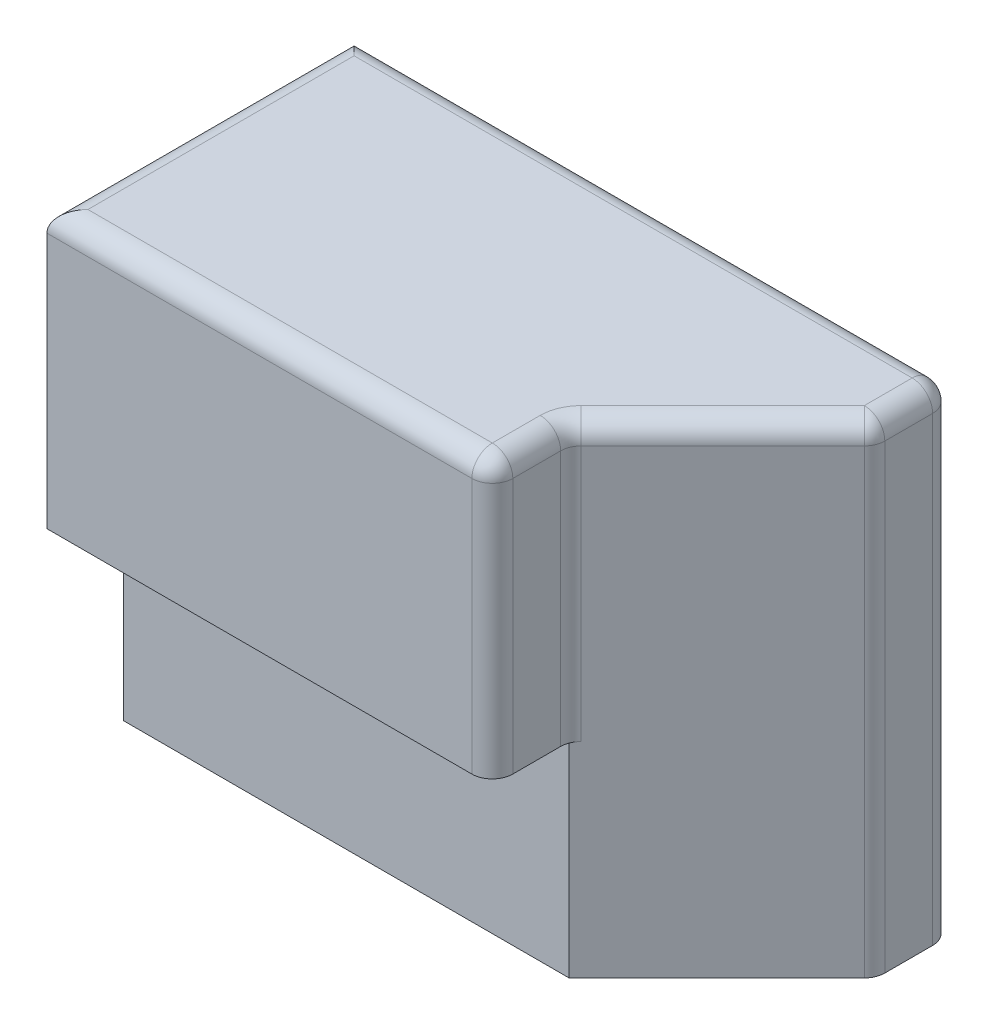
ISO-10303-21;
HEADER;
FILE_DESCRIPTION(('STEP AP214'),'2;1');
FILE_NAME('part.step','',(''),(''),'','','');
FILE_SCHEMA(('AUTOMOTIVE_DESIGN { 1 0 10303 214 1 1 1 1 }'));
ENDSEC;
DATA;
#1=APPLICATION_CONTEXT('core data for automotive mechanical design processes');
#2=APPLICATION_PROTOCOL_DEFINITION('international standard','automotive_design',2000,#1);
#3=PRODUCT_CONTEXT('',#1,'mechanical');
#4=PRODUCT('Part','Part','',(#3));
#5=PRODUCT_RELATED_PRODUCT_CATEGORY('part','',(#4));
#6=PRODUCT_DEFINITION_FORMATION('','',#4);
#7=PRODUCT_DEFINITION_CONTEXT('part definition',#1,'design');
#8=PRODUCT_DEFINITION('design','',#6,#7);
#9=PRODUCT_DEFINITION_SHAPE('','',#8);
#10=(LENGTH_UNIT() NAMED_UNIT(*) SI_UNIT(.MILLI.,.METRE.));
#11=(NAMED_UNIT(*) PLANE_ANGLE_UNIT() SI_UNIT($,.RADIAN.));
#12=(NAMED_UNIT(*) SI_UNIT($,.STERADIAN.) SOLID_ANGLE_UNIT());
#13=UNCERTAINTY_MEASURE_WITH_UNIT(LENGTH_MEASURE(1.E-05),#10,'distance_accuracy_value','');
#14=(GEOMETRIC_REPRESENTATION_CONTEXT(3) GLOBAL_UNCERTAINTY_ASSIGNED_CONTEXT((#13)) GLOBAL_UNIT_ASSIGNED_CONTEXT((#10,
#11,#12)) REPRESENTATION_CONTEXT('',''));
#15=CARTESIAN_POINT('',(0.,0.,0.));
#16=DIRECTION('',(0.,0.,1.));
#17=DIRECTION('',(1.,0.,0.));
#18=AXIS2_PLACEMENT_3D('',#15,#16,#17);
#19=CARTESIAN_POINT('',(0.,0.,7.62));
#20=DIRECTION('',(0.,1.,0.));
#21=DIRECTION('',(0.,0.,1.));
#22=AXIS2_PLACEMENT_3D('',#19,#20,#21);
#23=PLANE('',#22);
#24=DIRECTION('',(1.,0.,0.));
#25=VECTOR('',#24,1.);
#26=CARTESIAN_POINT('',(0.,0.,0.));
#27=LINE('',#26,#25);
#28=CARTESIAN_POINT('',(10.16,0.,0.));
#29=VERTEX_POINT('',#28);
#30=CARTESIAN_POINT('',(14.351,0.,0.));
#31=VERTEX_POINT('',#30);
#32=EDGE_CURVE('E269',#29,#31,#27,.T.);
#33=ORIENTED_EDGE('',*,*,#32,.T.);
#34=CARTESIAN_POINT('',(14.351,0.,0.508));
#35=DIRECTION('',(0.,1.,0.));
#36=DIRECTION('',(0.,0.,1.));
#37=AXIS2_PLACEMENT_3D('',#34,#35,#36);
#38=CIRCLE('',#37,0.508);
#39=CARTESIAN_POINT('',(14.859,0.,0.508000000000002));
#40=VERTEX_POINT('',#39);
#41=EDGE_CURVE('E330',#31,#40,#38,.F.);
#42=ORIENTED_EDGE('',*,*,#41,.T.);
#43=DIRECTION('',(0.,0.,-1.));
#44=VECTOR('',#43,1.);
#45=CARTESIAN_POINT('',(14.859,0.,7.62));
#46=LINE('',#45,#44);
#47=CARTESIAN_POINT('',(14.859,0.,1.69457951031445));
#48=VERTEX_POINT('',#47);
#49=EDGE_CURVE('E268',#48,#40,#46,.T.);
#50=ORIENTED_EDGE('',*,*,#49,.F.);
#51=CARTESIAN_POINT('',(14.351,0.,1.69457951031445));
#52=DIRECTION('',(0.,1.,0.));
#53=DIRECTION('',(0.,0.,1.));
#54=AXIS2_PLACEMENT_3D('',#51,#52,#53);
#55=CIRCLE('',#54,0.508);
#56=CARTESIAN_POINT('',(14.7102102448428,0.,2.05378975515721));
#57=VERTEX_POINT('',#56);
#58=EDGE_CURVE('E197',#48,#57,#55,.F.);
#59=ORIENTED_EDGE('',*,*,#58,.T.);
#60=DIRECTION('',(0.707106781186546,0.,-0.707106781186549));
#61=VECTOR('',#60,1.);
#62=CARTESIAN_POINT('',(8.38200000000002,0.,8.38199999999999));
#63=LINE('',#62,#61);
#64=CARTESIAN_POINT('',(11.049,0.,5.715));
#65=VERTEX_POINT('',#64);
#66=EDGE_CURVE('E179',#65,#57,#63,.T.);
#67=ORIENTED_EDGE('',*,*,#66,.F.);
#68=DIRECTION('',(1.,0.,0.));
#69=VECTOR('',#68,1.);
#70=CARTESIAN_POINT('',(0.,0.,5.715));
#71=LINE('',#70,#69);
#72=CARTESIAN_POINT('',(0.,0.,5.715));
#73=VERTEX_POINT('',#72);
#74=EDGE_CURVE('E193',#73,#65,#71,.T.);
#75=ORIENTED_EDGE('',*,*,#74,.F.);
#76=DIRECTION('',(0.,0.,-1.));
#77=VECTOR('',#76,1.);
#78=CARTESIAN_POINT('',(0.,0.,7.62));
#79=LINE('',#78,#77);
#80=CARTESIAN_POINT('',(0.,0.,2.794));
#81=VERTEX_POINT('',#80);
#82=EDGE_CURVE('E277',#73,#81,#79,.T.);
#83=ORIENTED_EDGE('',*,*,#82,.T.);
#84=DIRECTION('',(-1.,0.,0.));
#85=VECTOR('',#84,1.);
#86=CARTESIAN_POINT('',(0.,0.,2.794));
#87=LINE('',#86,#85);
#88=CARTESIAN_POINT('',(10.16,0.,2.794));
#89=VERTEX_POINT('',#88);
#90=EDGE_CURVE('E237',#89,#81,#87,.T.);
#91=ORIENTED_EDGE('',*,*,#90,.F.);
#92=DIRECTION('',(0.,0.,-1.));
#93=VECTOR('',#92,1.);
#94=CARTESIAN_POINT('',(10.16,0.,2.794));
#95=LINE('',#94,#93);
#96=EDGE_CURVE('E251',#89,#29,#95,.T.);
#97=ORIENTED_EDGE('',*,*,#96,.T.);
#98=EDGE_LOOP('',(#33,#42,#50,#59,#67,#75,#83,#91,#97));
#99=FACE_BOUND('',#98,.T.);
#100=ADVANCED_FACE('F39',(#99),#23,.F.);
#101=CARTESIAN_POINT('',(14.859,0.,7.62));
#102=DIRECTION('',(-1.,0.,0.));
#103=DIRECTION('',(0.,0.,1.));
#104=AXIS2_PLACEMENT_3D('',#101,#102,#103);
#105=PLANE('',#104);
#106=ORIENTED_EDGE('',*,*,#49,.T.);
#107=DIRECTION('',(0.,1.,0.));
#108=VECTOR('',#107,1.);
#109=CARTESIAN_POINT('',(14.859,11.938,0.508));
#110=LINE('',#109,#108);
#111=CARTESIAN_POINT('',(14.859,11.43,0.508));
#112=VERTEX_POINT('',#111);
#113=EDGE_CURVE('E319',#40,#112,#110,.T.);
#114=ORIENTED_EDGE('',*,*,#113,.T.);
#115=DIRECTION('',(0.,0.,-1.));
#116=VECTOR('',#115,1.);
#117=CARTESIAN_POINT('',(14.859,11.43,7.62));
#118=LINE('',#117,#116);
#119=CARTESIAN_POINT('',(14.859,11.43,1.69457951031445));
#120=VERTEX_POINT('',#119);
#121=EDGE_CURVE('E316',#112,#120,#118,.F.);
#122=ORIENTED_EDGE('',*,*,#121,.T.);
#123=DIRECTION('',(0.,1.,0.));
#124=VECTOR('',#123,1.);
#125=CARTESIAN_POINT('',(14.859,0.,1.69457951031445));
#126=LINE('',#125,#124);
#127=EDGE_CURVE('E313',#120,#48,#126,.F.);
#128=ORIENTED_EDGE('',*,*,#127,.T.);
#129=EDGE_LOOP('',(#106,#114,#122,#128));
#130=FACE_BOUND('',#129,.T.);
#131=ADVANCED_FACE('F473',(#130),#105,.F.);
#132=CARTESIAN_POINT('',(0.,11.938,7.62));
#133=DIRECTION('',(0.,-1.,0.));
#134=DIRECTION('',(0.,0.,-1.));
#135=AXIS2_PLACEMENT_3D('',#132,#133,#134);
#136=PLANE('',#135);
#137=DIRECTION('',(0.707106781186546,0.,-0.707106781186549));
#138=VECTOR('',#137,1.);
#139=CARTESIAN_POINT('',(14.4997897551572,11.938,1.54578975515722));
#140=LINE('',#139,#138);
#141=CARTESIAN_POINT('',(10.8385795103145,11.938,5.207));
#142=VERTEX_POINT('',#141);
#143=CARTESIAN_POINT('',(14.351,11.938,1.69457951031445));
#144=VERTEX_POINT('',#143);
#145=EDGE_CURVE('E307',#142,#144,#140,.T.);
#146=ORIENTED_EDGE('',*,*,#145,.T.);
#147=DIRECTION('',(0.,0.,-1.));
#148=VECTOR('',#147,1.);
#149=CARTESIAN_POINT('',(14.351,11.938,7.62));
#150=LINE('',#149,#148);
#151=CARTESIAN_POINT('',(14.351,11.938,0.508));
#152=VERTEX_POINT('',#151);
#153=EDGE_CURVE('E310',#144,#152,#150,.T.);
#154=ORIENTED_EDGE('',*,*,#153,.T.);
#155=DIRECTION('',(-1.,0.,0.));
#156=VECTOR('',#155,1.);
#157=CARTESIAN_POINT('',(0.,11.938,0.508));
#158=LINE('',#157,#156);
#159=CARTESIAN_POINT('',(0.508,11.938,0.508));
#160=VERTEX_POINT('',#159);
#161=EDGE_CURVE('E300',#152,#160,#158,.T.);
#162=ORIENTED_EDGE('',*,*,#161,.T.);
#163=DIRECTION('',(0.,0.,-1.));
#164=VECTOR('',#163,1.);
#165=CARTESIAN_POINT('',(0.508,11.938,7.62));
#166=LINE('',#165,#164);
#167=CARTESIAN_POINT('',(0.508,11.938,7.112));
#168=VERTEX_POINT('',#167);
#169=EDGE_CURVE('E293',#160,#168,#166,.F.);
#170=ORIENTED_EDGE('',*,*,#169,.T.);
#171=DIRECTION('',(-1.,0.,0.));
#172=VECTOR('',#171,1.);
#173=CARTESIAN_POINT('',(0.,11.938,7.112));
#174=LINE('',#173,#172);
#175=CARTESIAN_POINT('',(10.541,11.938,7.112));
#176=VERTEX_POINT('',#175);
#177=EDGE_CURVE('E290',#168,#176,#174,.F.);
#178=ORIENTED_EDGE('',*,*,#177,.T.);
#179=DIRECTION('',(0.,0.,1.));
#180=VECTOR('',#179,1.);
#181=CARTESIAN_POINT('',(10.541,11.938,7.62));
#182=LINE('',#181,#180);
#183=CARTESIAN_POINT('',(10.541,11.938,5.92542048968553));
#184=VERTEX_POINT('',#183);
#185=EDGE_CURVE('E296',#176,#184,#182,.F.);
#186=ORIENTED_EDGE('',*,*,#185,.T.);
#187=CARTESIAN_POINT('',(11.557,11.938,5.92542048968553));
#188=DIRECTION('',(0.,-1.,0.));
#189=DIRECTION('',(0.,0.,-1.));
#190=AXIS2_PLACEMENT_3D('',#187,#188,#189);
#191=CIRCLE('',#190,1.016);
#192=EDGE_CURVE('E303',#142,#184,#191,.F.);
#193=ORIENTED_EDGE('',*,*,#192,.F.);
#194=EDGE_LOOP('',(#146,#154,#162,#170,#178,#186,#193));
#195=FACE_BOUND('',#194,.T.);
#196=ADVANCED_FACE('F423',(#195),#136,.F.);
#197=CARTESIAN_POINT('',(0.,0.,5.715));
#198=DIRECTION('',(0.,0.,1.));
#199=DIRECTION('',(1.,0.,0.));
#200=AXIS2_PLACEMENT_3D('',#197,#198,#199);
#201=PLANE('',#200);
#202=ORIENTED_EDGE('',*,*,#74,.T.);
#203=DIRECTION('',(0.,1.,0.));
#204=VECTOR('',#203,1.);
#205=CARTESIAN_POINT('',(11.049,0.,5.715));
#206=LINE('',#205,#204);
#207=CARTESIAN_POINT('',(11.049,5.08,5.715));
#208=VERTEX_POINT('',#207);
#209=EDGE_CURVE('E176',#65,#208,#206,.T.);
#210=ORIENTED_EDGE('',*,*,#209,.T.);
#211=DIRECTION('',(1.,0.,0.));
#212=VECTOR('',#211,1.);
#213=CARTESIAN_POINT('',(0.,5.08,5.715));
#214=LINE('',#213,#212);
#215=CARTESIAN_POINT('',(0.,5.08,5.715));
#216=VERTEX_POINT('',#215);
#217=EDGE_CURVE('E210',#216,#208,#214,.T.);
#218=ORIENTED_EDGE('',*,*,#217,.F.);
#219=DIRECTION('',(0.,-1.,0.));
#220=VECTOR('',#219,1.);
#221=CARTESIAN_POINT('',(0.,0.,5.715));
#222=LINE('',#221,#220);
#223=EDGE_CURVE('E202',#216,#73,#222,.T.);
#224=ORIENTED_EDGE('',*,*,#223,.T.);
#225=EDGE_LOOP('',(#202,#210,#218,#224));
#226=FACE_BOUND('',#225,.T.);
#227=ADVANCED_FACE('F200',(#226),#201,.T.);
#228=CARTESIAN_POINT('',(0.,0.,7.62));
#229=DIRECTION('',(1.,0.,0.));
#230=DIRECTION('',(0.,0.,-1.));
#231=AXIS2_PLACEMENT_3D('',#228,#229,#230);
#232=PLANE('',#231);
#233=DIRECTION('',(0.,-1.,0.));
#234=VECTOR('',#233,1.);
#235=CARTESIAN_POINT('',(0.,0.,7.62));
#236=LINE('',#235,#234);
#237=CARTESIAN_POINT('',(0.,11.43,7.62));
#238=VERTEX_POINT('',#237);
#239=CARTESIAN_POINT('',(0.,5.08,7.62));
#240=VERTEX_POINT('',#239);
#241=EDGE_CURVE('E265',#238,#240,#236,.T.);
#242=ORIENTED_EDGE('',*,*,#241,.F.);
#243=DIRECTION('',(0.,0.,-1.));
#244=VECTOR('',#243,1.);
#245=CARTESIAN_POINT('',(0.,11.43,7.62));
#246=LINE('',#245,#244);
#247=CARTESIAN_POINT('',(0.,11.43,0.));
#248=VERTEX_POINT('',#247);
#249=EDGE_CURVE('E333',#238,#248,#246,.T.);
#250=ORIENTED_EDGE('',*,*,#249,.T.);
#251=DIRECTION('',(0.,-1.,0.));
#252=VECTOR('',#251,1.);
#253=CARTESIAN_POINT('',(0.,0.,0.));
#254=LINE('',#253,#252);
#255=CARTESIAN_POINT('',(0.,10.16,0.));
#256=VERTEX_POINT('',#255);
#257=EDGE_CURVE('E255',#248,#256,#254,.T.);
#258=ORIENTED_EDGE('',*,*,#257,.T.);
#259=DIRECTION('',(0.,0.,-1.));
#260=VECTOR('',#259,1.);
#261=CARTESIAN_POINT('',(0.,10.16,2.794));
#262=LINE('',#261,#260);
#263=CARTESIAN_POINT('',(0.,10.16,2.794));
#264=VERTEX_POINT('',#263);
#265=EDGE_CURVE('E241',#264,#256,#262,.T.);
#266=ORIENTED_EDGE('',*,*,#265,.F.);
#267=DIRECTION('',(0.,1.,0.));
#268=VECTOR('',#267,1.);
#269=CARTESIAN_POINT('',(0.,0.,2.794));
#270=LINE('',#269,#268);
#271=EDGE_CURVE('E220',#81,#264,#270,.T.);
#272=ORIENTED_EDGE('',*,*,#271,.F.);
#273=ORIENTED_EDGE('',*,*,#82,.F.);
#274=ORIENTED_EDGE('',*,*,#223,.F.);
#275=DIRECTION('',(0.,0.,1.));
#276=VECTOR('',#275,1.);
#277=CARTESIAN_POINT('',(0.,5.08,5.715));
#278=LINE('',#277,#276);
#279=EDGE_CURVE('E208',#216,#240,#278,.T.);
#280=ORIENTED_EDGE('',*,*,#279,.T.);
#281=EDGE_LOOP('',(#242,#250,#258,#266,#272,#273,#274,#280));
#282=FACE_BOUND('',#281,.T.);
#283=ADVANCED_FACE('F482',(#282),#232,.F.);
#284=CARTESIAN_POINT('',(0.,0.,7.62));
#285=DIRECTION('',(0.,0.,-1.));
#286=DIRECTION('',(-1.,0.,0.));
#287=AXIS2_PLACEMENT_3D('',#284,#285,#286);
#288=PLANE('',#287);
#289=DIRECTION('',(1.,0.,0.));
#290=VECTOR('',#289,1.);
#291=CARTESIAN_POINT('',(0.,5.08,7.62));
#292=LINE('',#291,#290);
#293=CARTESIAN_POINT('',(10.541,5.08,7.62));
#294=VERTEX_POINT('',#293);
#295=EDGE_CURVE('E188',#240,#294,#292,.T.);
#296=ORIENTED_EDGE('',*,*,#295,.T.);
#297=DIRECTION('',(0.,-1.,0.));
#298=VECTOR('',#297,1.);
#299=CARTESIAN_POINT('',(10.541,0.,7.62));
#300=LINE('',#299,#298);
#301=CARTESIAN_POINT('',(10.541,11.43,7.62));
#302=VERTEX_POINT('',#301);
#303=EDGE_CURVE('E49',#294,#302,#300,.F.);
#304=ORIENTED_EDGE('',*,*,#303,.T.);
#305=DIRECTION('',(-1.,0.,0.));
#306=VECTOR('',#305,1.);
#307=CARTESIAN_POINT('',(0.,11.43,7.62));
#308=LINE('',#307,#306);
#309=EDGE_CURVE('E349',#302,#238,#308,.T.);
#310=ORIENTED_EDGE('',*,*,#309,.T.);
#311=ORIENTED_EDGE('',*,*,#241,.T.);
#312=EDGE_LOOP('',(#296,#304,#310,#311));
#313=FACE_BOUND('',#312,.T.);
#314=ADVANCED_FACE('F485',(#313),#288,.F.);
#315=CARTESIAN_POINT('',(0.,0.,0.));
#316=DIRECTION('',(0.,0.,-1.));
#317=DIRECTION('',(-1.,0.,0.));
#318=AXIS2_PLACEMENT_3D('',#315,#316,#317);
#319=PLANE('',#318);
#320=DIRECTION('',(-1.,0.,0.));
#321=VECTOR('',#320,1.);
#322=CARTESIAN_POINT('',(14.859,11.43,0.));
#323=LINE('',#322,#321);
#324=CARTESIAN_POINT('',(14.351,11.43,0.));
#325=VERTEX_POINT('',#324);
#326=EDGE_CURVE('E322',#248,#325,#323,.F.);
#327=ORIENTED_EDGE('',*,*,#326,.T.);
#328=DIRECTION('',(0.,1.,0.));
#329=VECTOR('',#328,1.);
#330=CARTESIAN_POINT('',(14.351,0.,0.));
#331=LINE('',#330,#329);
#332=EDGE_CURVE('E325',#325,#31,#331,.F.);
#333=ORIENTED_EDGE('',*,*,#332,.T.);
#334=ORIENTED_EDGE('',*,*,#32,.F.);
#335=DIRECTION('',(0.,-1.,0.));
#336=VECTOR('',#335,1.);
#337=CARTESIAN_POINT('',(10.16,0.,0.));
#338=LINE('',#337,#336);
#339=CARTESIAN_POINT('',(10.16,8.255,0.));
#340=VERTEX_POINT('',#339);
#341=EDGE_CURVE('E225',#340,#29,#338,.T.);
#342=ORIENTED_EDGE('',*,*,#341,.F.);
#343=CARTESIAN_POINT('',(8.255,8.255,0.));
#344=DIRECTION('',(0.,0.,-1.));
#345=DIRECTION('',(-1.,0.,0.));
#346=AXIS2_PLACEMENT_3D('',#343,#344,#345);
#347=CIRCLE('',#346,1.905);
#348=CARTESIAN_POINT('',(8.255,10.16,0.));
#349=VERTEX_POINT('',#348);
#350=EDGE_CURVE('E245',#349,#340,#347,.T.);
#351=ORIENTED_EDGE('',*,*,#350,.F.);
#352=DIRECTION('',(1.,0.,0.));
#353=VECTOR('',#352,1.);
#354=CARTESIAN_POINT('',(0.,10.16,0.));
#355=LINE('',#354,#353);
#356=EDGE_CURVE('E218',#256,#349,#355,.T.);
#357=ORIENTED_EDGE('',*,*,#356,.F.);
#358=ORIENTED_EDGE('',*,*,#257,.F.);
#359=EDGE_LOOP('',(#327,#333,#334,#342,#351,#357,#358));
#360=FACE_BOUND('',#359,.T.);
#361=ADVANCED_FACE('F520',(#360),#319,.T.);
#362=CARTESIAN_POINT('',(10.16,0.,2.794));
#363=DIRECTION('',(1.,0.,0.));
#364=DIRECTION('',(0.,1.,0.));
#365=AXIS2_PLACEMENT_3D('',#362,#363,#364);
#366=PLANE('',#365);
#367=ORIENTED_EDGE('',*,*,#341,.T.);
#368=ORIENTED_EDGE('',*,*,#96,.F.);
#369=DIRECTION('',(0.,-1.,0.));
#370=VECTOR('',#369,1.);
#371=CARTESIAN_POINT('',(10.16,0.,2.794));
#372=LINE('',#371,#370);
#373=CARTESIAN_POINT('',(10.16,8.255,2.794));
#374=VERTEX_POINT('',#373);
#375=EDGE_CURVE('E233',#374,#89,#372,.T.);
#376=ORIENTED_EDGE('',*,*,#375,.F.);
#377=DIRECTION('',(0.,0.,-1.));
#378=VECTOR('',#377,1.);
#379=CARTESIAN_POINT('',(10.16,8.255,2.794));
#380=LINE('',#379,#378);
#381=EDGE_CURVE('E256',#374,#340,#380,.T.);
#382=ORIENTED_EDGE('',*,*,#381,.T.);
#383=EDGE_LOOP('',(#367,#368,#376,#382));
#384=FACE_BOUND('',#383,.T.);
#385=ADVANCED_FACE('F516',(#384),#366,.F.);
#386=CARTESIAN_POINT('',(8.255,8.255,2.794));
#387=DIRECTION('',(0.,0.,-1.));
#388=DIRECTION('',(-1.,0.,0.));
#389=AXIS2_PLACEMENT_3D('',#386,#387,#388);
#390=CYLINDRICAL_SURFACE('',#389,1.905);
#391=ORIENTED_EDGE('',*,*,#350,.T.);
#392=ORIENTED_EDGE('',*,*,#381,.F.);
#393=CARTESIAN_POINT('',(8.255,8.255,2.794));
#394=DIRECTION('',(0.,0.,-1.));
#395=DIRECTION('',(-1.,0.,0.));
#396=AXIS2_PLACEMENT_3D('',#393,#394,#395);
#397=CIRCLE('',#396,1.905);
#398=CARTESIAN_POINT('',(8.255,10.16,2.794));
#399=VERTEX_POINT('',#398);
#400=EDGE_CURVE('E229',#399,#374,#397,.T.);
#401=ORIENTED_EDGE('',*,*,#400,.F.);
#402=DIRECTION('',(0.,0.,-1.));
#403=VECTOR('',#402,1.);
#404=CARTESIAN_POINT('',(8.255,10.16,2.794));
#405=LINE('',#404,#403);
#406=EDGE_CURVE('E259',#399,#349,#405,.T.);
#407=ORIENTED_EDGE('',*,*,#406,.T.);
#408=EDGE_LOOP('',(#391,#392,#401,#407));
#409=FACE_BOUND('',#408,.T.);
#410=ADVANCED_FACE('F519',(#409),#390,.F.);
#411=CARTESIAN_POINT('',(0.,10.16,2.794));
#412=DIRECTION('',(0.,1.,0.));
#413=DIRECTION('',(-1.,0.,0.));
#414=AXIS2_PLACEMENT_3D('',#411,#412,#413);
#415=PLANE('',#414);
#416=ORIENTED_EDGE('',*,*,#356,.T.);
#417=ORIENTED_EDGE('',*,*,#406,.F.);
#418=DIRECTION('',(1.,0.,0.));
#419=VECTOR('',#418,1.);
#420=CARTESIAN_POINT('',(0.,10.16,2.794));
#421=LINE('',#420,#419);
#422=EDGE_CURVE('E224',#264,#399,#421,.T.);
#423=ORIENTED_EDGE('',*,*,#422,.F.);
#424=ORIENTED_EDGE('',*,*,#265,.T.);
#425=EDGE_LOOP('',(#416,#417,#423,#424));
#426=FACE_BOUND('',#425,.T.);
#427=ADVANCED_FACE('F514',(#426),#415,.F.);
#428=CARTESIAN_POINT('',(8.255,8.255,2.794));
#429=DIRECTION('',(0.,0.,-1.));
#430=DIRECTION('',(-1.,0.,0.));
#431=AXIS2_PLACEMENT_3D('',#428,#429,#430);
#432=PLANE('',#431);
#433=CARTESIAN_POINT('',(3.81,3.81,2.794));
#434=DIRECTION('',(0.,0.,-1.));
#435=DIRECTION('',(-1.,0.,0.));
#436=AXIS2_PLACEMENT_3D('',#433,#434,#435);
#437=CIRCLE('',#436,0.635000000000001);
#438=CARTESIAN_POINT('',(3.175,3.81,2.794));
#439=VERTEX_POINT('',#438);
#440=EDGE_CURVE('E744',#439,#439,#437,.T.);
#441=ORIENTED_EDGE('',*,*,#440,.F.);
#442=EDGE_LOOP('',(#441));
#443=FACE_BOUND('',#442,.T.);
#444=ORIENTED_EDGE('',*,*,#271,.T.);
#445=ORIENTED_EDGE('',*,*,#422,.T.);
#446=ORIENTED_EDGE('',*,*,#400,.T.);
#447=ORIENTED_EDGE('',*,*,#375,.T.);
#448=ORIENTED_EDGE('',*,*,#90,.T.);
#449=EDGE_LOOP('',(#444,#445,#446,#447,#448));
#450=FACE_BOUND('',#449,.T.);
#451=ADVANCED_FACE('F509',(#443,#450),#432,.T.);
#452=CARTESIAN_POINT('',(0.,5.08,5.715));
#453=DIRECTION('',(0.,-1.,0.));
#454=DIRECTION('',(0.,0.,-1.));
#455=AXIS2_PLACEMENT_3D('',#452,#453,#454);
#456=PLANE('',#455);
#457=DIRECTION('',(0.,0.,1.));
#458=VECTOR('',#457,1.);
#459=CARTESIAN_POINT('',(11.049,5.08,5.715));
#460=LINE('',#459,#458);
#461=CARTESIAN_POINT('',(11.049,5.08,5.92542048968553));
#462=VERTEX_POINT('',#461);
#463=CARTESIAN_POINT('',(11.049,5.08,7.112));
#464=VERTEX_POINT('',#463);
#465=EDGE_CURVE('E204',#462,#464,#460,.T.);
#466=ORIENTED_EDGE('',*,*,#465,.T.);
#467=CARTESIAN_POINT('',(10.541,5.08,7.112));
#468=DIRECTION('',(0.,-1.,0.));
#469=DIRECTION('',(0.,0.,-1.));
#470=AXIS2_PLACEMENT_3D('',#467,#468,#469);
#471=CIRCLE('',#470,0.508);
#472=EDGE_CURVE('E64',#464,#294,#471,.T.);
#473=ORIENTED_EDGE('',*,*,#472,.T.);
#474=ORIENTED_EDGE('',*,*,#295,.F.);
#475=ORIENTED_EDGE('',*,*,#279,.F.);
#476=ORIENTED_EDGE('',*,*,#217,.T.);
#477=DIRECTION('',(-0.707106781186546,0.,0.707106781186549));
#478=VECTOR('',#477,1.);
#479=CARTESIAN_POINT('',(5.52450000000002,5.08,11.2395));
#480=LINE('',#479,#478);
#481=CARTESIAN_POINT('',(11.1977897551572,5.08,5.56621024484276));
#482=VERTEX_POINT('',#481);
#483=EDGE_CURVE('E182',#482,#208,#480,.T.);
#484=ORIENTED_EDGE('',*,*,#483,.F.);
#485=CARTESIAN_POINT('',(11.557,5.08,5.92542048968553));
#486=DIRECTION('',(0.,-1.,0.));
#487=DIRECTION('',(0.,0.,-1.));
#488=AXIS2_PLACEMENT_3D('',#485,#486,#487);
#489=CIRCLE('',#488,0.508);
#490=EDGE_CURVE('E11',#482,#462,#489,.F.);
#491=ORIENTED_EDGE('',*,*,#490,.T.);
#492=EDGE_LOOP('',(#466,#473,#474,#475,#476,#484,#491));
#493=FACE_BOUND('',#492,.T.);
#494=ADVANCED_FACE('F444',(#493),#456,.T.);
#495=CARTESIAN_POINT('',(11.049,0.,5.715));
#496=DIRECTION('',(-1.,0.,0.));
#497=DIRECTION('',(0.,0.,1.));
#498=AXIS2_PLACEMENT_3D('',#495,#496,#497);
#499=PLANE('',#498);
#500=ORIENTED_EDGE('',*,*,#465,.F.);
#501=DIRECTION('',(0.,-1.,0.));
#502=VECTOR('',#501,1.);
#503=CARTESIAN_POINT('',(11.049,0.,5.92542048968553));
#504=LINE('',#503,#502);
#505=CARTESIAN_POINT('',(11.049,11.43,5.92542048968553));
#506=VERTEX_POINT('',#505);
#507=EDGE_CURVE('E287',#462,#506,#504,.F.);
#508=ORIENTED_EDGE('',*,*,#507,.T.);
#509=DIRECTION('',(0.,0.,1.));
#510=VECTOR('',#509,1.);
#511=CARTESIAN_POINT('',(11.049,11.43,5.715));
#512=LINE('',#511,#510);
#513=CARTESIAN_POINT('',(11.049,11.43,7.112));
#514=VERTEX_POINT('',#513);
#515=EDGE_CURVE('E283',#506,#514,#512,.T.);
#516=ORIENTED_EDGE('',*,*,#515,.T.);
#517=DIRECTION('',(0.,-1.,0.));
#518=VECTOR('',#517,1.);
#519=CARTESIAN_POINT('',(11.049,0.,7.112));
#520=LINE('',#519,#518);
#521=EDGE_CURVE('E280',#514,#464,#520,.T.);
#522=ORIENTED_EDGE('',*,*,#521,.T.);
#523=EDGE_LOOP('',(#500,#508,#516,#522));
#524=FACE_BOUND('',#523,.T.);
#525=ADVANCED_FACE('F446',(#524),#499,.F.);
#526=CARTESIAN_POINT('',(8.38200000000002,0.,8.38199999999999));
#527=DIRECTION('',(0.707106781186549,0.,0.707106781186546));
#528=DIRECTION('',(0.707106781186546,0.,-0.707106781186549));
#529=AXIS2_PLACEMENT_3D('',#526,#527,#528);
#530=PLANE('',#529);
#531=ORIENTED_EDGE('',*,*,#66,.T.);
#532=DIRECTION('',(0.,1.,0.));
#533=VECTOR('',#532,1.);
#534=CARTESIAN_POINT('',(14.7102102448428,11.938,2.05378975515721));
#535=LINE('',#534,#533);
#536=CARTESIAN_POINT('',(14.7102102448428,11.43,2.05378975515721));
#537=VERTEX_POINT('',#536);
#538=EDGE_CURVE('E344',#57,#537,#535,.T.);
#539=ORIENTED_EDGE('',*,*,#538,.T.);
#540=DIRECTION('',(0.707106781186546,0.,-0.707106781186549));
#541=VECTOR('',#540,1.);
#542=CARTESIAN_POINT('',(11.049,11.43,5.715));
#543=LINE('',#542,#541);
#544=CARTESIAN_POINT('',(11.1977897551572,11.43,5.56621024484276));
#545=VERTEX_POINT('',#544);
#546=EDGE_CURVE('E341',#537,#545,#543,.F.);
#547=ORIENTED_EDGE('',*,*,#546,.T.);
#548=DIRECTION('',(0.,-1.,0.));
#549=VECTOR('',#548,1.);
#550=CARTESIAN_POINT('',(11.1977897551572,0.,5.56621024484276));
#551=LINE('',#550,#549);
#552=EDGE_CURVE('E338',#545,#482,#551,.T.);
#553=ORIENTED_EDGE('',*,*,#552,.T.);
#554=ORIENTED_EDGE('',*,*,#483,.T.);
#555=ORIENTED_EDGE('',*,*,#209,.F.);
#556=EDGE_LOOP('',(#531,#539,#547,#553,#554,#555));
#557=FACE_BOUND('',#556,.T.);
#558=ADVANCED_FACE('F178',(#557),#530,.T.);
#559=CARTESIAN_POINT('',(14.351,0.,0.508));
#560=DIRECTION('',(0.,-1.,0.));
#561=DIRECTION('',(0.,0.,-1.));
#562=AXIS2_PLACEMENT_3D('',#559,#560,#561);
#563=CYLINDRICAL_SURFACE('',#562,0.508);
#564=CARTESIAN_POINT('',(14.351,11.43,0.508));
#565=DIRECTION('',(0.,1.,0.));
#566=DIRECTION('',(0.,0.,1.));
#567=AXIS2_PLACEMENT_3D('',#564,#565,#566);
#568=CIRCLE('',#567,0.508);
#569=EDGE_CURVE('E43',#112,#325,#568,.T.);
#570=ORIENTED_EDGE('',*,*,#569,.F.);
#571=ORIENTED_EDGE('',*,*,#113,.F.);
#572=ORIENTED_EDGE('',*,*,#41,.F.);
#573=ORIENTED_EDGE('',*,*,#332,.F.);
#574=EDGE_LOOP('',(#570,#571,#572,#573));
#575=FACE_BOUND('',#574,.T.);
#576=ADVANCED_FACE('F41',(#575),#563,.T.);
#577=CARTESIAN_POINT('',(14.351,11.43,0.508));
#578=DIRECTION('',(1.,0.,0.));
#579=DIRECTION('',(0.,0.,-1.));
#580=AXIS2_PLACEMENT_3D('',#577,#578,#579);
#581=SPHERICAL_SURFACE('',#580,0.508);
#582=CARTESIAN_POINT('',(14.351,11.43,0.508));
#583=DIRECTION('',(1.,0.,0.));
#584=DIRECTION('',(0.,0.,-1.));
#585=AXIS2_PLACEMENT_3D('',#582,#583,#584);
#586=CIRCLE('',#585,0.508);
#587=EDGE_CURVE('E397',#152,#325,#586,.F.);
#588=ORIENTED_EDGE('',*,*,#587,.F.);
#589=CARTESIAN_POINT('',(14.351,11.43,0.508));
#590=DIRECTION('',(0.,0.,-1.));
#591=DIRECTION('',(-1.,0.,0.));
#592=AXIS2_PLACEMENT_3D('',#589,#590,#591);
#593=CIRCLE('',#592,0.508);
#594=EDGE_CURVE('E400',#112,#152,#593,.F.);
#595=ORIENTED_EDGE('',*,*,#594,.F.);
#596=ORIENTED_EDGE('',*,*,#569,.T.);
#597=EDGE_LOOP('',(#588,#595,#596));
#598=FACE_BOUND('',#597,.T.);
#599=ADVANCED_FACE('F412',(#598),#581,.T.);
#600=CARTESIAN_POINT('',(14.351,11.43,7.62));
#601=DIRECTION('',(0.,0.,-1.));
#602=DIRECTION('',(-1.,0.,0.));
#603=AXIS2_PLACEMENT_3D('',#600,#601,#602);
#604=CYLINDRICAL_SURFACE('',#603,0.508);
#605=ORIENTED_EDGE('',*,*,#594,.T.);
#606=ORIENTED_EDGE('',*,*,#153,.F.);
#607=CARTESIAN_POINT('',(14.351,11.43,1.69457951031445));
#608=DIRECTION('',(0.,0.,1.));
#609=DIRECTION('',(0.,-1.,0.));
#610=AXIS2_PLACEMENT_3D('',#607,#608,#609);
#611=CIRCLE('',#610,0.508);
#612=EDGE_CURVE('E393',#120,#144,#611,.T.);
#613=ORIENTED_EDGE('',*,*,#612,.F.);
#614=ORIENTED_EDGE('',*,*,#121,.F.);
#615=EDGE_LOOP('',(#605,#606,#613,#614));
#616=FACE_BOUND('',#615,.T.);
#617=ADVANCED_FACE('F427',(#616),#604,.T.);
#618=CARTESIAN_POINT('',(14.351,0.,1.69457951031445));
#619=DIRECTION('',(0.,-1.,0.));
#620=DIRECTION('',(0.,0.,-1.));
#621=AXIS2_PLACEMENT_3D('',#618,#619,#620);
#622=CYLINDRICAL_SURFACE('',#621,0.508);
#623=ORIENTED_EDGE('',*,*,#58,.F.);
#624=ORIENTED_EDGE('',*,*,#127,.F.);
#625=CARTESIAN_POINT('',(14.351,11.43,1.69457951031445));
#626=DIRECTION('',(0.,1.,0.));
#627=DIRECTION('',(0.,0.,1.));
#628=AXIS2_PLACEMENT_3D('',#625,#626,#627);
#629=CIRCLE('',#628,0.508);
#630=EDGE_CURVE('E389',#537,#120,#629,.T.);
#631=ORIENTED_EDGE('',*,*,#630,.F.);
#632=ORIENTED_EDGE('',*,*,#538,.F.);
#633=EDGE_LOOP('',(#623,#624,#631,#632));
#634=FACE_BOUND('',#633,.T.);
#635=ADVANCED_FACE('F597',(#634),#622,.T.);
#636=CARTESIAN_POINT('',(0.,11.43,0.508));
#637=DIRECTION('',(1.,0.,0.));
#638=DIRECTION('',(0.,0.,-1.));
#639=AXIS2_PLACEMENT_3D('',#636,#637,#638);
#640=CYLINDRICAL_SURFACE('',#639,0.508);
#641=ORIENTED_EDGE('',*,*,#587,.T.);
#642=ORIENTED_EDGE('',*,*,#326,.F.);
#643=CARTESIAN_POINT('',(0.508,11.43,0.508));
#644=DIRECTION('',(0.707106781186547,0.,-0.707106781186547));
#645=DIRECTION('',(0.707106781186547,0.,0.707106781186547));
#646=AXIS2_PLACEMENT_3D('',#643,#644,#645);
#647=ELLIPSE('',#646,0.718420489685532,0.508);
#648=EDGE_CURVE('E385',#160,#248,#647,.F.);
#649=ORIENTED_EDGE('',*,*,#648,.F.);
#650=ORIENTED_EDGE('',*,*,#161,.F.);
#651=EDGE_LOOP('',(#641,#642,#649,#650));
#652=FACE_BOUND('',#651,.T.);
#653=ADVANCED_FACE('F419',(#652),#640,.T.);
#654=CARTESIAN_POINT('',(14.351,11.43,1.69457951031445));
#655=DIRECTION('',(0.,1.,0.));
#656=DIRECTION('',(0.,0.,1.));
#657=AXIS2_PLACEMENT_3D('',#654,#655,#656);
#658=SPHERICAL_SURFACE('',#657,0.508);
#659=ORIENTED_EDGE('',*,*,#630,.T.);
#660=ORIENTED_EDGE('',*,*,#612,.T.);
#661=CARTESIAN_POINT('',(14.351,11.43,1.69457951031445));
#662=DIRECTION('',(0.707106781186544,0.,-0.707106781186551));
#663=DIRECTION('',(-0.707106781186551,0.,-0.707106781186544));
#664=AXIS2_PLACEMENT_3D('',#661,#662,#663);
#665=CIRCLE('',#664,0.508);
#666=EDGE_CURVE('E381',#537,#144,#665,.F.);
#667=ORIENTED_EDGE('',*,*,#666,.F.);
#668=EDGE_LOOP('',(#659,#660,#667));
#669=FACE_BOUND('',#668,.T.);
#670=ADVANCED_FACE('F430',(#669),#658,.T.);
#671=CARTESIAN_POINT('',(0.508,11.43,7.62));
#672=DIRECTION('',(0.,0.,-1.));
#673=DIRECTION('',(-1.,0.,0.));
#674=AXIS2_PLACEMENT_3D('',#671,#672,#673);
#675=CYLINDRICAL_SURFACE('',#674,0.508);
#676=ORIENTED_EDGE('',*,*,#648,.T.);
#677=ORIENTED_EDGE('',*,*,#249,.F.);
#678=CARTESIAN_POINT('',(0.508,11.43,7.112));
#679=DIRECTION('',(-0.707106781186547,0.,-0.707106781186547));
#680=DIRECTION('',(-0.707106781186547,0.,0.707106781186547));
#681=AXIS2_PLACEMENT_3D('',#678,#679,#680);
#682=ELLIPSE('',#681,0.718420489685532,0.508);
#683=EDGE_CURVE('E377',#168,#238,#682,.F.);
#684=ORIENTED_EDGE('',*,*,#683,.F.);
#685=ORIENTED_EDGE('',*,*,#169,.F.);
#686=EDGE_LOOP('',(#676,#677,#684,#685));
#687=FACE_BOUND('',#686,.T.);
#688=ADVANCED_FACE('F617',(#687),#675,.T.);
#689=CARTESIAN_POINT('',(4.21278975515725,11.43,11.8327897551572));
#690=DIRECTION('',(-0.707106781186546,0.,0.707106781186549));
#691=DIRECTION('',(0.707106781186549,0.,0.707106781186546));
#692=AXIS2_PLACEMENT_3D('',#689,#690,#691);
#693=CYLINDRICAL_SURFACE('',#692,0.508);
#694=ORIENTED_EDGE('',*,*,#666,.T.);
#695=ORIENTED_EDGE('',*,*,#145,.F.);
#696=CARTESIAN_POINT('',(10.8385795103145,11.43,5.207));
#697=DIRECTION('',(-0.707106781186547,0.,0.707106781186548));
#698=DIRECTION('',(0.707106781186548,0.,0.707106781186547));
#699=AXIS2_PLACEMENT_3D('',#696,#697,#698);
#700=CIRCLE('',#699,0.508);
#701=EDGE_CURVE('E373',#545,#142,#700,.T.);
#702=ORIENTED_EDGE('',*,*,#701,.F.);
#703=ORIENTED_EDGE('',*,*,#546,.F.);
#704=EDGE_LOOP('',(#694,#695,#702,#703));
#705=FACE_BOUND('',#704,.T.);
#706=ADVANCED_FACE('F434',(#705),#693,.T.);
#707=CARTESIAN_POINT('',(11.557,0.,5.92542048968553));
#708=DIRECTION('',(0.,-1.,0.));
#709=DIRECTION('',(0.,0.,-1.));
#710=AXIS2_PLACEMENT_3D('',#707,#708,#709);
#711=CYLINDRICAL_SURFACE('',#710,0.508);
#712=ORIENTED_EDGE('',*,*,#490,.F.);
#713=ORIENTED_EDGE('',*,*,#552,.F.);
#714=CARTESIAN_POINT('',(11.557,11.43,5.92542048968553));
#715=DIRECTION('',(0.,-1.,0.));
#716=DIRECTION('',(0.,0.,-1.));
#717=AXIS2_PLACEMENT_3D('',#714,#715,#716);
#718=CIRCLE('',#717,0.508);
#719=EDGE_CURVE('E369',#506,#545,#718,.T.);
#720=ORIENTED_EDGE('',*,*,#719,.F.);
#721=ORIENTED_EDGE('',*,*,#507,.F.);
#722=EDGE_LOOP('',(#712,#713,#720,#721));
#723=FACE_BOUND('',#722,.T.);
#724=ADVANCED_FACE('F440',(#723),#711,.F.);
#725=CARTESIAN_POINT('',(10.541,0.,7.112));
#726=DIRECTION('',(0.,-1.,0.));
#727=DIRECTION('',(0.,0.,-1.));
#728=AXIS2_PLACEMENT_3D('',#725,#726,#727);
#729=CYLINDRICAL_SURFACE('',#728,0.508);
#730=ORIENTED_EDGE('',*,*,#472,.F.);
#731=ORIENTED_EDGE('',*,*,#521,.F.);
#732=CARTESIAN_POINT('',(10.541,11.43,7.112));
#733=DIRECTION('',(0.,1.,0.));
#734=DIRECTION('',(-1.,0.,0.));
#735=AXIS2_PLACEMENT_3D('',#732,#733,#734);
#736=CIRCLE('',#735,0.508);
#737=EDGE_CURVE('E365',#302,#514,#736,.T.);
#738=ORIENTED_EDGE('',*,*,#737,.F.);
#739=ORIENTED_EDGE('',*,*,#303,.F.);
#740=EDGE_LOOP('',(#730,#731,#738,#739));
#741=FACE_BOUND('',#740,.T.);
#742=ADVANCED_FACE('F451',(#741),#729,.T.);
#743=CARTESIAN_POINT('',(0.,11.43,7.112));
#744=DIRECTION('',(-1.,0.,0.));
#745=DIRECTION('',(0.,0.,1.));
#746=AXIS2_PLACEMENT_3D('',#743,#744,#745);
#747=CYLINDRICAL_SURFACE('',#746,0.508);
#748=ORIENTED_EDGE('',*,*,#683,.T.);
#749=ORIENTED_EDGE('',*,*,#309,.F.);
#750=CARTESIAN_POINT('',(10.541,11.43,7.112));
#751=DIRECTION('',(1.,0.,0.));
#752=DIRECTION('',(0.,0.,-1.));
#753=AXIS2_PLACEMENT_3D('',#750,#751,#752);
#754=CIRCLE('',#753,0.508);
#755=EDGE_CURVE('E361',#176,#302,#754,.T.);
#756=ORIENTED_EDGE('',*,*,#755,.F.);
#757=ORIENTED_EDGE('',*,*,#177,.F.);
#758=EDGE_LOOP('',(#748,#749,#756,#757));
#759=FACE_BOUND('',#758,.T.);
#760=ADVANCED_FACE('F459',(#759),#747,.T.);
#761=CARTESIAN_POINT('',(11.557,11.43,5.92542048968553));
#762=DIRECTION('',(0.,-1.,0.));
#763=DIRECTION('',(0.,0.,-1.));
#764=AXIS2_PLACEMENT_3D('',#761,#762,#763);
#765=TOROIDAL_SURFACE('',#764,1.016,0.508);
#766=ORIENTED_EDGE('',*,*,#701,.T.);
#767=ORIENTED_EDGE('',*,*,#192,.T.);
#768=CARTESIAN_POINT('',(10.541,11.43,5.92542048968553));
#769=DIRECTION('',(0.,0.,-1.));
#770=DIRECTION('',(-1.,0.,0.));
#771=AXIS2_PLACEMENT_3D('',#768,#769,#770);
#772=CIRCLE('',#771,0.508);
#773=EDGE_CURVE('E357',#506,#184,#772,.F.);
#774=ORIENTED_EDGE('',*,*,#773,.F.);
#775=ORIENTED_EDGE('',*,*,#719,.T.);
#776=EDGE_LOOP('',(#766,#767,#774,#775));
#777=FACE_BOUND('',#776,.T.);
#778=ADVANCED_FACE('F463',(#777),#765,.T.);
#779=CARTESIAN_POINT('',(10.541,11.43,7.112));
#780=DIRECTION('',(0.,0.,1.));
#781=DIRECTION('',(1.,0.,0.));
#782=AXIS2_PLACEMENT_3D('',#779,#780,#781);
#783=SPHERICAL_SURFACE('',#782,0.508);
#784=ORIENTED_EDGE('',*,*,#755,.T.);
#785=ORIENTED_EDGE('',*,*,#737,.T.);
#786=CARTESIAN_POINT('',(10.541,11.43,7.112));
#787=DIRECTION('',(0.,0.,1.));
#788=DIRECTION('',(1.,0.,0.));
#789=AXIS2_PLACEMENT_3D('',#786,#787,#788);
#790=CIRCLE('',#789,0.508);
#791=EDGE_CURVE('E354',#176,#514,#790,.F.);
#792=ORIENTED_EDGE('',*,*,#791,.F.);
#793=EDGE_LOOP('',(#784,#785,#792));
#794=FACE_BOUND('',#793,.T.);
#795=ADVANCED_FACE('F455',(#794),#783,.T.);
#796=CARTESIAN_POINT('',(10.541,11.43,5.715));
#797=DIRECTION('',(0.,0.,1.));
#798=DIRECTION('',(1.,0.,0.));
#799=AXIS2_PLACEMENT_3D('',#796,#797,#798);
#800=CYLINDRICAL_SURFACE('',#799,0.508);
#801=ORIENTED_EDGE('',*,*,#773,.T.);
#802=ORIENTED_EDGE('',*,*,#185,.F.);
#803=ORIENTED_EDGE('',*,*,#791,.T.);
#804=ORIENTED_EDGE('',*,*,#515,.F.);
#805=EDGE_LOOP('',(#801,#802,#803,#804));
#806=FACE_BOUND('',#805,.T.);
#807=ADVANCED_FACE('F461',(#806),#800,.T.);
#808=CARTESIAN_POINT('',(3.81,3.81,4.699));
#809=DIRECTION('',(0.,0.,-1.));
#810=DIRECTION('',(-1.,0.,0.));
#811=AXIS2_PLACEMENT_3D('',#808,#809,#810);
#812=CYLINDRICAL_SURFACE('',#811,0.635000000000001);
#813=CARTESIAN_POINT('',(3.81,3.81,4.699));
#814=DIRECTION('',(0.,0.,-1.));
#815=DIRECTION('',(-1.,0.,0.));
#816=AXIS2_PLACEMENT_3D('',#813,#814,#815);
#817=CIRCLE('',#816,0.635000000000001);
#818=CARTESIAN_POINT('',(3.175,3.81,4.699));
#819=VERTEX_POINT('',#818);
#820=EDGE_CURVE('E358',#819,#819,#817,.T.);
#821=ORIENTED_EDGE('',*,*,#820,.F.);
#822=EDGE_LOOP('',(#821));
#823=FACE_BOUND('',#822,.T.);
#824=ORIENTED_EDGE('',*,*,#440,.T.);
#825=EDGE_LOOP('',(#824));
#826=FACE_BOUND('',#825,.T.);
#827=ADVANCED_FACE('F488',(#823,#826),#812,.F.);
#828=CARTESIAN_POINT('',(3.81,3.81,4.699));
#829=DIRECTION('',(0.,0.,-1.));
#830=DIRECTION('',(-1.,0.,0.));
#831=AXIS2_PLACEMENT_3D('',#828,#829,#830);
#832=PLANE('',#831);
#833=ORIENTED_EDGE('',*,*,#820,.T.);
#834=EDGE_LOOP('',(#833));
#835=FACE_BOUND('',#834,.T.);
#836=ADVANCED_FACE('F492',(#835),#832,.T.);
#837=CLOSED_SHELL('',(#100,#131,#196,#227,#283,#314,#361,#385,#410,#427,#451,#494,#525,#558,
#576,#599,#617,#635,#653,#670,#688,#706,#724,#742,#760,#778,#795,#807,#827,#836));
#838=MANIFOLD_SOLID_BREP('B2',#837);
#839=ADVANCED_BREP_SHAPE_REPRESENTATION('',(#18,#838),#14);
#840=SHAPE_DEFINITION_REPRESENTATION(#9,#839);
ENDSEC;
END-ISO-10303-21;
